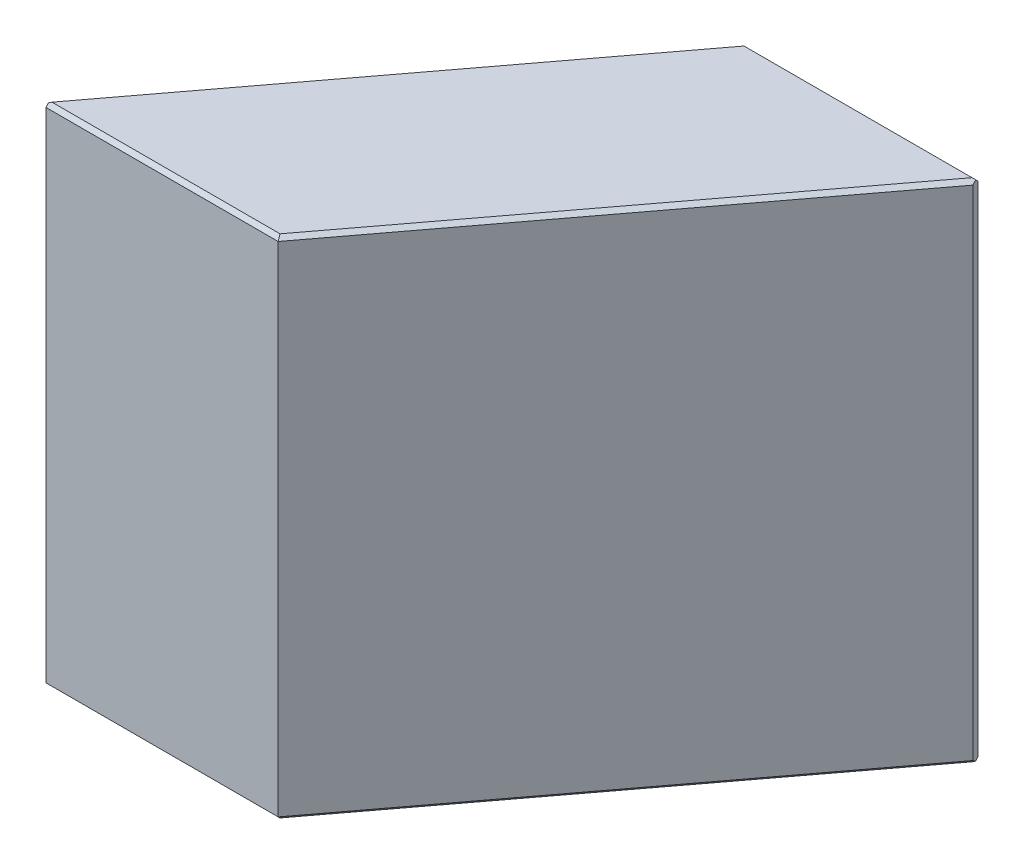
ISO-10303-21;
HEADER;
FILE_DESCRIPTION(('STEP AP214'),'2;1');
FILE_NAME('part.step','',(''),(''),'','','');
FILE_SCHEMA(('AUTOMOTIVE_DESIGN { 1 0 10303 214 1 1 1 1 }'));
ENDSEC;
DATA;
#1=APPLICATION_CONTEXT('core data for automotive mechanical design processes');
#2=APPLICATION_PROTOCOL_DEFINITION('international standard','automotive_design',2000,#1);
#3=PRODUCT_CONTEXT('',#1,'mechanical');
#4=PRODUCT('Part','Part','',(#3));
#5=PRODUCT_RELATED_PRODUCT_CATEGORY('part','',(#4));
#6=PRODUCT_DEFINITION_FORMATION('','',#4);
#7=PRODUCT_DEFINITION_CONTEXT('part definition',#1,'design');
#8=PRODUCT_DEFINITION('design','',#6,#7);
#9=PRODUCT_DEFINITION_SHAPE('','',#8);
#10=(LENGTH_UNIT() NAMED_UNIT(*) SI_UNIT(.MILLI.,.METRE.));
#11=(NAMED_UNIT(*) PLANE_ANGLE_UNIT() SI_UNIT($,.RADIAN.));
#12=(NAMED_UNIT(*) SI_UNIT($,.STERADIAN.) SOLID_ANGLE_UNIT());
#13=UNCERTAINTY_MEASURE_WITH_UNIT(LENGTH_MEASURE(1.E-05),#10,'distance_accuracy_value','');
#14=(GEOMETRIC_REPRESENTATION_CONTEXT(3) GLOBAL_UNCERTAINTY_ASSIGNED_CONTEXT((#13)) GLOBAL_UNIT_ASSIGNED_CONTEXT((#10,
#11,#12)) REPRESENTATION_CONTEXT('',''));
#15=CARTESIAN_POINT('',(0.,0.,0.));
#16=DIRECTION('',(0.,0.,1.));
#17=DIRECTION('',(1.,0.,0.));
#18=AXIS2_PLACEMENT_3D('',#15,#16,#17);
#19=CARTESIAN_POINT('',(0.,20.,0.));
#20=DIRECTION('',(0.798635510047294,0.,0.601815023152046));
#21=DIRECTION('',(0.601815023152046,0.,-0.798635510047294));
#22=AXIS2_PLACEMENT_3D('',#19,#20,#21);
#23=PLANE('',#22);
#24=DIRECTION('',(-0.601815023152046,0.,0.798635510047294));
#25=VECTOR('',#24,1.);
#26=CARTESIAN_POINT('',(0.,0.150000000000001,0.));
#27=LINE('',#26,#25);
#28=CARTESIAN_POINT('',(11.9815093966344,0.150000000000001,-15.9));
#29=VERTEX_POINT('',#28);
#30=CARTESIAN_POINT('',(0.180544506945615,0.150000000000001,-0.239590653014189));
#31=VERTEX_POINT('',#30);
#32=EDGE_CURVE('E132',#29,#31,#27,.T.);
#33=ORIENTED_EDGE('',*,*,#32,.T.);
#34=DIRECTION('',(0.,1.,0.));
#35=VECTOR('',#34,1.);
#36=CARTESIAN_POINT('',(0.180544506945615,20.,-0.239590653014189));
#37=LINE('',#36,#35);
#38=CARTESIAN_POINT('',(0.180544506945616,19.85,-0.239590653014193));
#39=VERTEX_POINT('',#38);
#40=EDGE_CURVE('E128',#31,#39,#37,.T.);
#41=ORIENTED_EDGE('',*,*,#40,.T.);
#42=DIRECTION('',(0.601815023152046,0.,-0.798635510047294));
#43=VECTOR('',#42,1.);
#44=CARTESIAN_POINT('',(0.,19.85,0.));
#45=LINE('',#44,#43);
#46=CARTESIAN_POINT('',(11.9815093966344,19.85,-15.9));
#47=VERTEX_POINT('',#46);
#48=EDGE_CURVE('E123',#39,#47,#45,.T.);
#49=ORIENTED_EDGE('',*,*,#48,.T.);
#50=DIRECTION('',(0.,-1.,0.));
#51=VECTOR('',#50,1.);
#52=CARTESIAN_POINT('',(11.9815093966344,20.,-15.9));
#53=LINE('',#52,#51);
#54=EDGE_CURVE('E126',#47,#29,#53,.T.);
#55=ORIENTED_EDGE('',*,*,#54,.T.);
#56=EDGE_LOOP('',(#33,#41,#49,#55));
#57=FACE_BOUND('',#56,.T.);
#58=ADVANCED_FACE('F36',(#57),#23,.F.);
#59=CARTESIAN_POINT('',(0.,20.,0.));
#60=DIRECTION('',(0.,0.,-1.));
#61=DIRECTION('',(-1.,0.,0.));
#62=AXIS2_PLACEMENT_3D('',#59,#60,#61);
#63=PLANE('',#62);
#64=DIRECTION('',(-1.,0.,0.));
#65=VECTOR('',#64,1.);
#66=CARTESIAN_POINT('',(0.,19.85,0.));
#67=LINE('',#66,#65);
#68=CARTESIAN_POINT('',(9.39101743617168,19.85,0.));
#69=VERTEX_POINT('',#68);
#70=CARTESIAN_POINT('',(0.214216777307121,19.85,0.));
#71=VERTEX_POINT('',#70);
#72=EDGE_CURVE('E186',#69,#71,#67,.T.);
#73=ORIENTED_EDGE('',*,*,#72,.T.);
#74=DIRECTION('',(0.,-1.,0.));
#75=VECTOR('',#74,1.);
#76=CARTESIAN_POINT('',(0.214216777307121,20.,0.));
#77=LINE('',#76,#75);
#78=CARTESIAN_POINT('',(0.214216777307119,0.150000000000001,0.));
#79=VERTEX_POINT('',#78);
#80=EDGE_CURVE('E204',#71,#79,#77,.T.);
#81=ORIENTED_EDGE('',*,*,#80,.T.);
#82=DIRECTION('',(1.,0.,0.));
#83=VECTOR('',#82,1.);
#84=CARTESIAN_POINT('',(9.39101743617168,0.150000000000001,0.));
#85=LINE('',#84,#83);
#86=CARTESIAN_POINT('',(9.39101743617168,0.150000000000001,0.));
#87=VERTEX_POINT('',#86);
#88=EDGE_CURVE('E189',#79,#87,#85,.T.);
#89=ORIENTED_EDGE('',*,*,#88,.T.);
#90=DIRECTION('',(0.,-1.,0.));
#91=VECTOR('',#90,1.);
#92=CARTESIAN_POINT('',(9.39101743617168,20.,0.));
#93=LINE('',#92,#91);
#94=EDGE_CURVE('E145',#69,#87,#93,.T.);
#95=ORIENTED_EDGE('',*,*,#94,.F.);
#96=EDGE_LOOP('',(#73,#81,#89,#95));
#97=FACE_BOUND('',#96,.T.);
#98=ADVANCED_FACE('F270',(#97),#63,.F.);
#99=CARTESIAN_POINT('',(9.39101743617168,20.,0.));
#100=DIRECTION('',(-0.798635510047294,0.,-0.601815023152046));
#101=DIRECTION('',(-0.601815023152046,0.,0.798635510047294));
#102=AXIS2_PLACEMENT_3D('',#99,#100,#101);
#103=PLANE('',#102);
#104=DIRECTION('',(0.601815023152046,0.,-0.798635510047294));
#105=VECTOR('',#104,1.);
#106=CARTESIAN_POINT('',(21.372526832806,0.150000000000001,-15.9));
#107=LINE('',#106,#105);
#108=CARTESIAN_POINT('',(21.1919823258604,0.150000000000001,-15.6604093469858));
#109=VERTEX_POINT('',#108);
#110=EDGE_CURVE('E193',#87,#109,#107,.T.);
#111=ORIENTED_EDGE('',*,*,#110,.T.);
#112=DIRECTION('',(0.,1.,0.));
#113=VECTOR('',#112,1.);
#114=CARTESIAN_POINT('',(21.1919823258604,20.,-15.6604093469858));
#115=LINE('',#114,#113);
#116=CARTESIAN_POINT('',(21.1919823258604,19.85,-15.6604093469858));
#117=VERTEX_POINT('',#116);
#118=EDGE_CURVE('E57',#109,#117,#115,.T.);
#119=ORIENTED_EDGE('',*,*,#118,.T.);
#120=DIRECTION('',(-0.601815023152046,0.,0.798635510047294));
#121=VECTOR('',#120,1.);
#122=CARTESIAN_POINT('',(9.39101743617168,19.85,0.));
#123=LINE('',#122,#121);
#124=EDGE_CURVE('E191',#117,#69,#123,.T.);
#125=ORIENTED_EDGE('',*,*,#124,.T.);
#126=ORIENTED_EDGE('',*,*,#94,.T.);
#127=EDGE_LOOP('',(#111,#119,#125,#126));
#128=FACE_BOUND('',#127,.T.);
#129=ADVANCED_FACE('F229',(#128),#103,.F.);
#130=CARTESIAN_POINT('',(11.9815093966344,20.,-15.9));
#131=DIRECTION('',(0.,0.,1.));
#132=DIRECTION('',(1.,0.,0.));
#133=AXIS2_PLACEMENT_3D('',#130,#131,#132);
#134=PLANE('',#133);
#135=DIRECTION('',(1.,0.,0.));
#136=VECTOR('',#135,1.);
#137=CARTESIAN_POINT('',(11.9815093966344,19.85,-15.9));
#138=LINE('',#137,#136);
#139=CARTESIAN_POINT('',(21.1583100554989,19.85,-15.9));
#140=VERTEX_POINT('',#139);
#141=EDGE_CURVE('E140',#47,#140,#138,.T.);
#142=ORIENTED_EDGE('',*,*,#141,.T.);
#143=DIRECTION('',(0.,-1.,0.));
#144=VECTOR('',#143,1.);
#145=CARTESIAN_POINT('',(21.1583100554989,20.,-15.9));
#146=LINE('',#145,#144);
#147=CARTESIAN_POINT('',(21.1583100554989,0.150000000000001,-15.9));
#148=VERTEX_POINT('',#147);
#149=EDGE_CURVE('E216',#140,#148,#146,.T.);
#150=ORIENTED_EDGE('',*,*,#149,.T.);
#151=DIRECTION('',(-1.,0.,0.));
#152=VECTOR('',#151,1.);
#153=CARTESIAN_POINT('',(11.9815093966344,0.150000000000001,-15.9));
#154=LINE('',#153,#152);
#155=EDGE_CURVE('E143',#148,#29,#154,.T.);
#156=ORIENTED_EDGE('',*,*,#155,.T.);
#157=ORIENTED_EDGE('',*,*,#54,.F.);
#158=EDGE_LOOP('',(#142,#150,#156,#157));
#159=FACE_BOUND('',#158,.T.);
#160=ADVANCED_FACE('F138',(#159),#134,.F.);
#161=CARTESIAN_POINT('',(11.9815093966344,20.,-15.9));
#162=DIRECTION('',(0.,-1.,0.));
#163=DIRECTION('',(0.,0.,-1.));
#164=AXIS2_PLACEMENT_3D('',#161,#162,#163);
#165=PLANE('',#164);
#166=DIRECTION('',(-0.601815023152046,0.,0.798635510047294));
#167=VECTOR('',#166,1.);
#168=CARTESIAN_POINT('',(12.1013047231415,20.,-15.8097277465272));
#169=LINE('',#168,#167);
#170=CARTESIAN_POINT('',(12.0562966378424,20.,-15.75));
#171=VERTEX_POINT('',#170);
#172=CARTESIAN_POINT('',(0.300853456238863,20.,-0.150000000000004));
#173=VERTEX_POINT('',#172);
#174=EDGE_CURVE('E158',#171,#173,#169,.T.);
#175=ORIENTED_EDGE('',*,*,#174,.T.);
#176=DIRECTION('',(1.,0.,0.));
#177=VECTOR('',#176,1.);
#178=CARTESIAN_POINT('',(11.9815093966344,20.,-0.150000000000004));
#179=LINE('',#178,#177);
#180=CARTESIAN_POINT('',(9.31623019496366,20.,-0.150000000000004));
#181=VERTEX_POINT('',#180);
#182=EDGE_CURVE('E201',#173,#181,#179,.T.);
#183=ORIENTED_EDGE('',*,*,#182,.T.);
#184=DIRECTION('',(0.601815023152046,0.,-0.798635510047294));
#185=VECTOR('',#184,1.);
#186=CARTESIAN_POINT('',(17.851480395482,20.,-11.4766595798325));
#187=LINE('',#186,#185);
#188=CARTESIAN_POINT('',(21.0716733765672,20.,-15.75));
#189=VERTEX_POINT('',#188);
#190=EDGE_CURVE('E198',#181,#189,#187,.T.);
#191=ORIENTED_EDGE('',*,*,#190,.T.);
#192=DIRECTION('',(-1.,0.,0.));
#193=VECTOR('',#192,1.);
#194=CARTESIAN_POINT('',(11.9815093966344,20.,-15.75));
#195=LINE('',#194,#193);
#196=EDGE_CURVE('E195',#189,#171,#195,.T.);
#197=ORIENTED_EDGE('',*,*,#196,.T.);
#198=EDGE_LOOP('',(#175,#183,#191,#197));
#199=FACE_BOUND('',#198,.T.);
#200=ADVANCED_FACE('F257',(#199),#165,.F.);
#201=CARTESIAN_POINT('',(11.9815093966344,0.,-15.9));
#202=DIRECTION('',(0.,-1.,0.));
#203=DIRECTION('',(0.,0.,-1.));
#204=AXIS2_PLACEMENT_3D('',#201,#202,#203);
#205=PLANE('',#204);
#206=DIRECTION('',(0.601815023152046,0.,-0.798635510047294));
#207=VECTOR('',#206,1.);
#208=CARTESIAN_POINT('',(12.1013047231415,0.,-15.8097277465272));
#209=LINE('',#208,#207);
#210=CARTESIAN_POINT('',(0.300853456238854,0.,-0.150000000000001));
#211=VERTEX_POINT('',#210);
#212=CARTESIAN_POINT('',(12.0562966378424,0.,-15.75));
#213=VERTEX_POINT('',#212);
#214=EDGE_CURVE('E181',#211,#213,#209,.T.);
#215=ORIENTED_EDGE('',*,*,#214,.T.);
#216=DIRECTION('',(1.,0.,0.));
#217=VECTOR('',#216,1.);
#218=CARTESIAN_POINT('',(21.372526832806,0.,-15.75));
#219=LINE('',#218,#217);
#220=CARTESIAN_POINT('',(21.0716733765672,0.,-15.75));
#221=VERTEX_POINT('',#220);
#222=EDGE_CURVE('E133',#213,#221,#219,.T.);
#223=ORIENTED_EDGE('',*,*,#222,.T.);
#224=DIRECTION('',(-0.601815023152046,0.,0.798635510047294));
#225=VECTOR('',#224,1.);
#226=CARTESIAN_POINT('',(9.27122210966458,0.,-0.0902722534728075));
#227=LINE('',#226,#225);
#228=CARTESIAN_POINT('',(9.31623019496366,0.,-0.150000000000001));
#229=VERTEX_POINT('',#228);
#230=EDGE_CURVE('E177',#221,#229,#227,.T.);
#231=ORIENTED_EDGE('',*,*,#230,.T.);
#232=DIRECTION('',(-1.,0.,0.));
#233=VECTOR('',#232,1.);
#234=CARTESIAN_POINT('',(0.,0.,-0.150000000000001));
#235=LINE('',#234,#233);
#236=EDGE_CURVE('E179',#229,#211,#235,.T.);
#237=ORIENTED_EDGE('',*,*,#236,.T.);
#238=EDGE_LOOP('',(#215,#223,#231,#237));
#239=FACE_BOUND('',#238,.T.);
#240=ADVANCED_FACE('F259',(#239),#205,.T.);
#241=CARTESIAN_POINT('',(0.,0.150000000000001,0.));
#242=DIRECTION('',(0.,-0.707106781186548,0.707106781186548));
#243=DIRECTION('',(0.,-0.707106781186548,-0.707106781186548));
#244=AXIS2_PLACEMENT_3D('',#241,#242,#243);
#245=PLANE('',#244);
#246=ORIENTED_EDGE('',*,*,#88,.F.);
#247=DIRECTION('',(0.0988902636106825,0.703640787534026,0.703640787534026));
#248=VECTOR('',#247,1.);
#249=CARTESIAN_POINT('',(0.212121890553502,0.135094106221481,-0.0149058937785196));
#250=LINE('',#249,#248);
#251=CARTESIAN_POINT('',(0.200189297925312,0.0501892979253112,-0.0998107020746897));
#252=VERTEX_POINT('',#251);
#253=EDGE_CURVE('E207',#79,#252,#250,.F.);
#254=ORIENTED_EDGE('',*,*,#253,.T.);
#255=DIRECTION('',(0.817268654327932,-0.407475119886486,-0.407475119886486));
#256=VECTOR('',#255,1.);
#257=CARTESIAN_POINT('',(0.,0.150000000000001,0.));
#258=LINE('',#257,#256);
#259=EDGE_CURVE('E169',#211,#252,#258,.F.);
#260=ORIENTED_EDGE('',*,*,#259,.F.);
#261=ORIENTED_EDGE('',*,*,#236,.F.);
#262=DIRECTION('',(-0.332492407540099,-0.666876599877439,-0.666876599877439));
#263=VECTOR('',#262,1.);
#264=CARTESIAN_POINT('',(9.39101743617168,0.150000000000001,0.));
#265=LINE('',#264,#263);
#266=EDGE_CURVE('E146',#87,#229,#265,.T.);
#267=ORIENTED_EDGE('',*,*,#266,.F.);
#268=EDGE_LOOP('',(#246,#254,#260,#261,#267));
#269=FACE_BOUND('',#268,.T.);
#270=ADVANCED_FACE('F265',(#269),#245,.T.);
#271=CARTESIAN_POINT('',(9.39101743617168,0.150000000000001,0.));
#272=DIRECTION('',(0.564720584850819,-0.707106781186548,0.425547483890751));
#273=DIRECTION('',(0.781388634880016,0.62404471096256,0.));
#274=AXIS2_PLACEMENT_3D('',#271,#272,#273);
#275=PLANE('',#274);
#276=DIRECTION('',(0.817268654327932,0.407475119886486,-0.407475119886486));
#277=VECTOR('',#276,1.);
#278=CARTESIAN_POINT('',(8.07477596321572,-6.48001401205428,-9.26998598794572));
#279=LINE('',#278,#277);
#280=CARTESIAN_POINT('',(21.1723375348807,0.0501892979253059,-15.8001892979253));
#281=VERTEX_POINT('',#280);
#282=EDGE_CURVE('E162',#281,#221,#279,.F.);
#283=ORIENTED_EDGE('',*,*,#282,.F.);
#284=DIRECTION('',(-0.113634361091002,-0.577350269189625,-0.808550492329395));
#285=VECTOR('',#284,1.);
#286=CARTESIAN_POINT('',(22.4784638116261,6.686318988228,-6.5066179347609));
#287=LINE('',#286,#285);
#288=EDGE_CURVE('E220',#281,#109,#287,.F.);
#289=ORIENTED_EDGE('',*,*,#288,.T.);
#290=ORIENTED_EDGE('',*,*,#110,.F.);
#291=ORIENTED_EDGE('',*,*,#266,.T.);
#292=ORIENTED_EDGE('',*,*,#230,.F.);
#293=EDGE_LOOP('',(#283,#289,#290,#291,#292));
#294=FACE_BOUND('',#293,.T.);
#295=ADVANCED_FACE('F226',(#294),#275,.T.);
#296=CARTESIAN_POINT('',(0.,0.150000000000001,0.));
#297=DIRECTION('',(-0.564720584850819,-0.707106781186548,-0.425547483890751));
#298=DIRECTION('',(0.781388634880016,-0.62404471096256,0.));
#299=AXIS2_PLACEMENT_3D('',#296,#297,#298);
#300=PLANE('',#299);
#301=ORIENTED_EDGE('',*,*,#259,.T.);
#302=DIRECTION('',(0.113634361091005,-0.577350269189626,0.808550492329394));
#303=VECTOR('',#302,1.);
#304=CARTESIAN_POINT('',(0.20022655563514,0.0500000000000005,-0.0995455996942549));
#305=LINE('',#304,#303);
#306=EDGE_CURVE('E209',#252,#31,#305,.F.);
#307=ORIENTED_EDGE('',*,*,#306,.T.);
#308=ORIENTED_EDGE('',*,*,#32,.F.);
#309=DIRECTION('',(0.332492407540099,-0.666876599877439,0.666876599877439));
#310=VECTOR('',#309,1.);
#311=CARTESIAN_POINT('',(14.1824685011672,-4.26444102426045,-11.4855589757396));
#312=LINE('',#311,#310);
#313=EDGE_CURVE('E159',#213,#29,#312,.F.);
#314=ORIENTED_EDGE('',*,*,#313,.F.);
#315=ORIENTED_EDGE('',*,*,#214,.F.);
#316=EDGE_LOOP('',(#301,#307,#308,#314,#315));
#317=FACE_BOUND('',#316,.T.);
#318=ADVANCED_FACE('F240',(#317),#300,.T.);
#319=CARTESIAN_POINT('',(11.9815093966344,0.150000000000001,-15.9));
#320=DIRECTION('',(0.,-0.707106781186548,-0.707106781186548));
#321=DIRECTION('',(0.,0.707106781186548,-0.707106781186548));
#322=AXIS2_PLACEMENT_3D('',#319,#320,#321);
#323=PLANE('',#322);
#324=ORIENTED_EDGE('',*,*,#155,.F.);
#325=DIRECTION('',(-0.0988902636106796,0.703640787534027,-0.703640787534027));
#326=VECTOR('',#325,1.);
#327=CARTESIAN_POINT('',(21.0685675134697,0.788551366364586,-16.5385513663646));
#328=LINE('',#327,#326);
#329=EDGE_CURVE('E218',#148,#281,#328,.F.);
#330=ORIENTED_EDGE('',*,*,#329,.T.);
#331=ORIENTED_EDGE('',*,*,#282,.T.);
#332=ORIENTED_EDGE('',*,*,#222,.F.);
#333=ORIENTED_EDGE('',*,*,#313,.T.);
#334=EDGE_LOOP('',(#324,#330,#331,#332,#333));
#335=FACE_BOUND('',#334,.T.);
#336=ADVANCED_FACE('F234',(#335),#323,.T.);
#337=CARTESIAN_POINT('',(11.9815093966344,20.,-15.75));
#338=DIRECTION('',(0.,-0.707106781186556,0.707106781186539));
#339=DIRECTION('',(0.,-0.707106781186539,-0.707106781186556));
#340=AXIS2_PLACEMENT_3D('',#337,#338,#339);
#341=PLANE('',#340);
#342=DIRECTION('',(0.817268654327931,-0.407475119886482,-0.407475119886491));
#343=VECTOR('',#342,1.);
#344=CARTESIAN_POINT('',(15.0000978448458,23.0271758920235,-12.7228241079764));
#345=LINE('',#344,#343);
#346=CARTESIAN_POINT('',(21.1723375348807,19.9498107020747,-15.8001892979253));
#347=VERTEX_POINT('',#346);
#348=EDGE_CURVE('E160',#347,#189,#345,.F.);
#349=ORIENTED_EDGE('',*,*,#348,.F.);
#350=DIRECTION('',(-0.0988902636106807,-0.703640787534018,-0.703640787534035));
#351=VECTOR('',#350,1.);
#352=CARTESIAN_POINT('',(21.0894424803596,19.3599817409999,-16.3900182590001));
#353=LINE('',#352,#351);
#354=EDGE_CURVE('E11',#347,#140,#353,.T.);
#355=ORIENTED_EDGE('',*,*,#354,.T.);
#356=ORIENTED_EDGE('',*,*,#141,.F.);
#357=DIRECTION('',(0.332492407540111,0.666876599877429,0.666876599877444));
#358=VECTOR('',#357,1.);
#359=CARTESIAN_POINT('',(12.048028818502,19.9834173198392,-15.7665826801608));
#360=LINE('',#359,#358);
#361=EDGE_CURVE('E152',#171,#47,#360,.F.);
#362=ORIENTED_EDGE('',*,*,#361,.F.);
#363=ORIENTED_EDGE('',*,*,#196,.F.);
#364=EDGE_LOOP('',(#349,#355,#356,#362,#363));
#365=FACE_BOUND('',#364,.T.);
#366=ADVANCED_FACE('F150',(#365),#341,.F.);
#367=CARTESIAN_POINT('',(12.1013047231415,20.,-15.8097277465272));
#368=DIRECTION('',(0.564720584850809,-0.70710678118656,0.425547483890744));
#369=DIRECTION('',(0.781388634880026,0.624044710962547,0.));
#370=AXIS2_PLACEMENT_3D('',#367,#368,#369);
#371=PLANE('',#370);
#372=ORIENTED_EDGE('',*,*,#48,.F.);
#373=DIRECTION('',(0.113634361091007,0.577350269189613,0.808550492329403));
#374=VECTOR('',#373,1.);
#375=CARTESIAN_POINT('',(-1.08625493013058,13.4136810117721,-9.2533370119193));
#376=LINE('',#375,#374);
#377=CARTESIAN_POINT('',(0.200189297925312,19.9498107020747,-0.0998107020746885));
#378=VERTEX_POINT('',#377);
#379=EDGE_CURVE('E212',#39,#378,#376,.T.);
#380=ORIENTED_EDGE('',*,*,#379,.T.);
#381=DIRECTION('',(0.817268654327937,0.407475119886476,-0.407475119886485));
#382=VECTOR('',#381,1.);
#383=CARTESIAN_POINT('',(13.397655862461,26.5298248040521,-6.67982480405225));
#384=LINE('',#383,#382);
#385=EDGE_CURVE('E164',#173,#378,#384,.F.);
#386=ORIENTED_EDGE('',*,*,#385,.F.);
#387=ORIENTED_EDGE('',*,*,#174,.F.);
#388=ORIENTED_EDGE('',*,*,#361,.T.);
#389=EDGE_LOOP('',(#372,#380,#386,#387,#388));
#390=FACE_BOUND('',#389,.T.);
#391=ADVANCED_FACE('F156',(#390),#371,.F.);
#392=CARTESIAN_POINT('',(17.851480395482,20.,-11.4766595798325));
#393=DIRECTION('',(-0.564720584850819,-0.707106781186548,-0.425547483890751));
#394=DIRECTION('',(0.781388634880016,-0.62404471096256,0.));
#395=AXIS2_PLACEMENT_3D('',#392,#393,#394);
#396=PLANE('',#395);
#397=ORIENTED_EDGE('',*,*,#124,.F.);
#398=DIRECTION('',(-0.113634361091002,0.577350269189625,-0.808550492329395));
#399=VECTOR('',#398,1.);
#400=CARTESIAN_POINT('',(21.5234054160892,18.166114874743,-13.3022115254732));
#401=LINE('',#400,#399);
#402=EDGE_CURVE('E43',#117,#347,#401,.T.);
#403=ORIENTED_EDGE('',*,*,#402,.T.);
#404=ORIENTED_EDGE('',*,*,#348,.T.);
#405=ORIENTED_EDGE('',*,*,#190,.F.);
#406=DIRECTION('',(0.332492407540086,-0.666876599877435,0.66687659987745));
#407=VECTOR('',#406,1.);
#408=CARTESIAN_POINT('',(7.74833619960666,23.1447088501288,-3.29470885012884));
#409=LINE('',#408,#407);
#410=EDGE_CURVE('E251',#69,#181,#409,.F.);
#411=ORIENTED_EDGE('',*,*,#410,.F.);
#412=EDGE_LOOP('',(#397,#403,#404,#405,#411));
#413=FACE_BOUND('',#412,.T.);
#414=ADVANCED_FACE('F255',(#413),#396,.F.);
#415=CARTESIAN_POINT('',(11.9815093966344,20.,-0.150000000000004));
#416=DIRECTION('',(0.,-0.707106781186556,-0.707106781186539));
#417=DIRECTION('',(0.,0.707106781186539,-0.707106781186556));
#418=AXIS2_PLACEMENT_3D('',#415,#416,#417);
#419=PLANE('',#418);
#420=ORIENTED_EDGE('',*,*,#385,.T.);
#421=DIRECTION('',(0.0988902636106836,-0.703640787534018,0.703640787534034));
#422=VECTOR('',#421,1.);
#423=CARTESIAN_POINT('',(0.308417509641421,19.1797269613221,0.670273038677886));
#424=LINE('',#423,#422);
#425=EDGE_CURVE('E214',#378,#71,#424,.T.);
#426=ORIENTED_EDGE('',*,*,#425,.T.);
#427=ORIENTED_EDGE('',*,*,#72,.F.);
#428=ORIENTED_EDGE('',*,*,#410,.T.);
#429=ORIENTED_EDGE('',*,*,#182,.F.);
#430=EDGE_LOOP('',(#420,#426,#427,#428,#429));
#431=FACE_BOUND('',#430,.T.);
#432=ADVANCED_FACE('F249',(#431),#419,.F.);
#433=CARTESIAN_POINT('',(0.214216777307121,20.,0.));
#434=DIRECTION('',(0.99026806874157,0.,-0.139173100960069));
#435=DIRECTION('',(-0.139173100960069,0.,-0.99026806874157));
#436=AXIS2_PLACEMENT_3D('',#433,#434,#435);
#437=PLANE('',#436);
#438=ORIENTED_EDGE('',*,*,#379,.F.);
#439=ORIENTED_EDGE('',*,*,#40,.F.);
#440=ORIENTED_EDGE('',*,*,#306,.F.);
#441=ORIENTED_EDGE('',*,*,#253,.F.);
#442=ORIENTED_EDGE('',*,*,#80,.F.);
#443=ORIENTED_EDGE('',*,*,#425,.F.);
#444=EDGE_LOOP('',(#438,#439,#440,#441,#442,#443));
#445=FACE_BOUND('',#444,.T.);
#446=ADVANCED_FACE('F243',(#445),#437,.F.);
#447=CARTESIAN_POINT('',(21.1583100554989,20.,-15.9));
#448=DIRECTION('',(-0.99026806874157,0.,0.139173100960065));
#449=DIRECTION('',(0.139173100960065,0.,0.99026806874157));
#450=AXIS2_PLACEMENT_3D('',#447,#448,#449);
#451=PLANE('',#450);
#452=ORIENTED_EDGE('',*,*,#402,.F.);
#453=ORIENTED_EDGE('',*,*,#118,.F.);
#454=ORIENTED_EDGE('',*,*,#288,.F.);
#455=ORIENTED_EDGE('',*,*,#329,.F.);
#456=ORIENTED_EDGE('',*,*,#149,.F.);
#457=ORIENTED_EDGE('',*,*,#354,.F.);
#458=EDGE_LOOP('',(#452,#453,#454,#455,#456,#457));
#459=FACE_BOUND('',#458,.T.);
#460=ADVANCED_FACE('F232',(#459),#451,.F.);
#461=CLOSED_SHELL('',(#58,#98,#129,#160,#200,#240,#270,#295,#318,#336,#366,#391,#414,#432,#446,#460));
#462=MANIFOLD_SOLID_BREP('B2',#461);
#463=ADVANCED_BREP_SHAPE_REPRESENTATION('',(#18,#462),#14);
#464=SHAPE_DEFINITION_REPRESENTATION(#9,#463);
ENDSEC;
END-ISO-10303-21;
